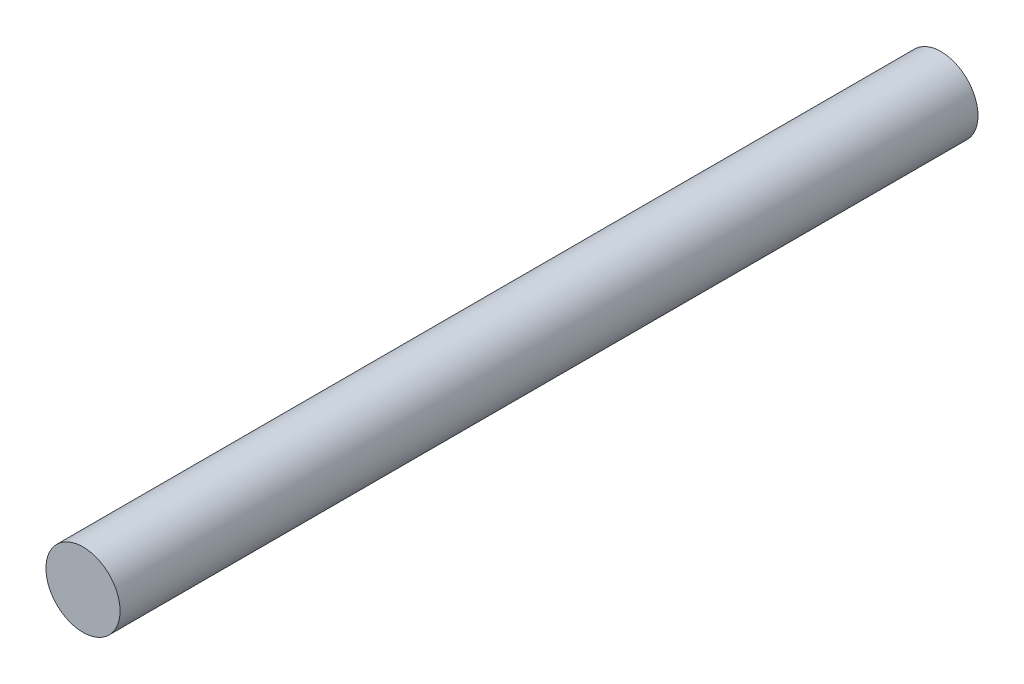
ISO-10303-21;
HEADER;
FILE_DESCRIPTION(('STEP AP214'),'2;1');
FILE_NAME('part.step','',(''),(''),'','','');
FILE_SCHEMA(('AUTOMOTIVE_DESIGN { 1 0 10303 214 1 1 1 1 }'));
ENDSEC;
DATA;
#1=APPLICATION_CONTEXT('core data for automotive mechanical design processes');
#2=APPLICATION_PROTOCOL_DEFINITION('international standard','automotive_design',2000,#1);
#3=PRODUCT_CONTEXT('',#1,'mechanical');
#4=PRODUCT('Part','Part','',(#3));
#5=PRODUCT_RELATED_PRODUCT_CATEGORY('part','',(#4));
#6=PRODUCT_DEFINITION_FORMATION('','',#4);
#7=PRODUCT_DEFINITION_CONTEXT('part definition',#1,'design');
#8=PRODUCT_DEFINITION('design','',#6,#7);
#9=PRODUCT_DEFINITION_SHAPE('','',#8);
#10=(LENGTH_UNIT() NAMED_UNIT(*) SI_UNIT(.MILLI.,.METRE.));
#11=(NAMED_UNIT(*) PLANE_ANGLE_UNIT() SI_UNIT($,.RADIAN.));
#12=(NAMED_UNIT(*) SI_UNIT($,.STERADIAN.) SOLID_ANGLE_UNIT());
#13=UNCERTAINTY_MEASURE_WITH_UNIT(LENGTH_MEASURE(1.E-05),#10,'distance_accuracy_value','');
#14=(GEOMETRIC_REPRESENTATION_CONTEXT(3) GLOBAL_UNCERTAINTY_ASSIGNED_CONTEXT((#13)) GLOBAL_UNIT_ASSIGNED_CONTEXT((#10,
#11,#12)) REPRESENTATION_CONTEXT('',''));
#15=CARTESIAN_POINT('',(0.,0.,0.));
#16=DIRECTION('',(0.,0.,1.));
#17=DIRECTION('',(1.,0.,0.));
#18=AXIS2_PLACEMENT_3D('',#15,#16,#17);
#19=CARTESIAN_POINT('',(0.,0.,110.));
#20=DIRECTION('',(0.,0.,-1.));
#21=DIRECTION('',(-1.,0.,0.));
#22=AXIS2_PLACEMENT_3D('',#19,#20,#21);
#23=CYLINDRICAL_SURFACE('',#22,4.75);
#24=CARTESIAN_POINT('',(0.,0.,110.));
#25=DIRECTION('',(0.,0.,1.));
#26=DIRECTION('',(1.,0.,0.));
#27=AXIS2_PLACEMENT_3D('',#24,#25,#26);
#28=CIRCLE('',#27,4.75);
#29=CARTESIAN_POINT('',(4.75,0.,110.));
#30=VERTEX_POINT('',#29);
#31=EDGE_CURVE('E10',#30,#30,#28,.T.);
#32=ORIENTED_EDGE('',*,*,#31,.F.);
#33=EDGE_LOOP('',(#32));
#34=FACE_BOUND('',#33,.T.);
#35=CARTESIAN_POINT('',(0.,0.,0.));
#36=DIRECTION('',(0.,0.,1.));
#37=DIRECTION('',(1.,0.,0.));
#38=AXIS2_PLACEMENT_3D('',#35,#36,#37);
#39=CIRCLE('',#38,4.75);
#40=CARTESIAN_POINT('',(4.75,0.,0.));
#41=VERTEX_POINT('',#40);
#42=EDGE_CURVE('E38',#41,#41,#39,.T.);
#43=ORIENTED_EDGE('',*,*,#42,.T.);
#44=EDGE_LOOP('',(#43));
#45=FACE_BOUND('',#44,.T.);
#46=ADVANCED_FACE('F35',(#34,#45),#23,.T.);
#47=CARTESIAN_POINT('',(0.,0.,110.));
#48=DIRECTION('',(0.,0.,1.));
#49=DIRECTION('',(1.,0.,0.));
#50=AXIS2_PLACEMENT_3D('',#47,#48,#49);
#51=PLANE('',#50);
#52=ORIENTED_EDGE('',*,*,#31,.T.);
#53=EDGE_LOOP('',(#52));
#54=FACE_BOUND('',#53,.T.);
#55=ADVANCED_FACE('F50',(#54),#51,.T.);
#56=CARTESIAN_POINT('',(0.,0.,0.));
#57=DIRECTION('',(0.,0.,1.));
#58=DIRECTION('',(1.,0.,0.));
#59=AXIS2_PLACEMENT_3D('',#56,#57,#58);
#60=PLANE('',#59);
#61=ORIENTED_EDGE('',*,*,#42,.F.);
#62=EDGE_LOOP('',(#61));
#63=FACE_BOUND('',#62,.T.);
#64=ADVANCED_FACE('F48',(#63),#60,.F.);
#65=CLOSED_SHELL('',(#46,#55,#64));
#66=MANIFOLD_SOLID_BREP('B2',#65);
#67=ADVANCED_BREP_SHAPE_REPRESENTATION('',(#18,#66),#14);
#68=SHAPE_DEFINITION_REPRESENTATION(#9,#67);
ENDSEC;
END-ISO-10303-21;
